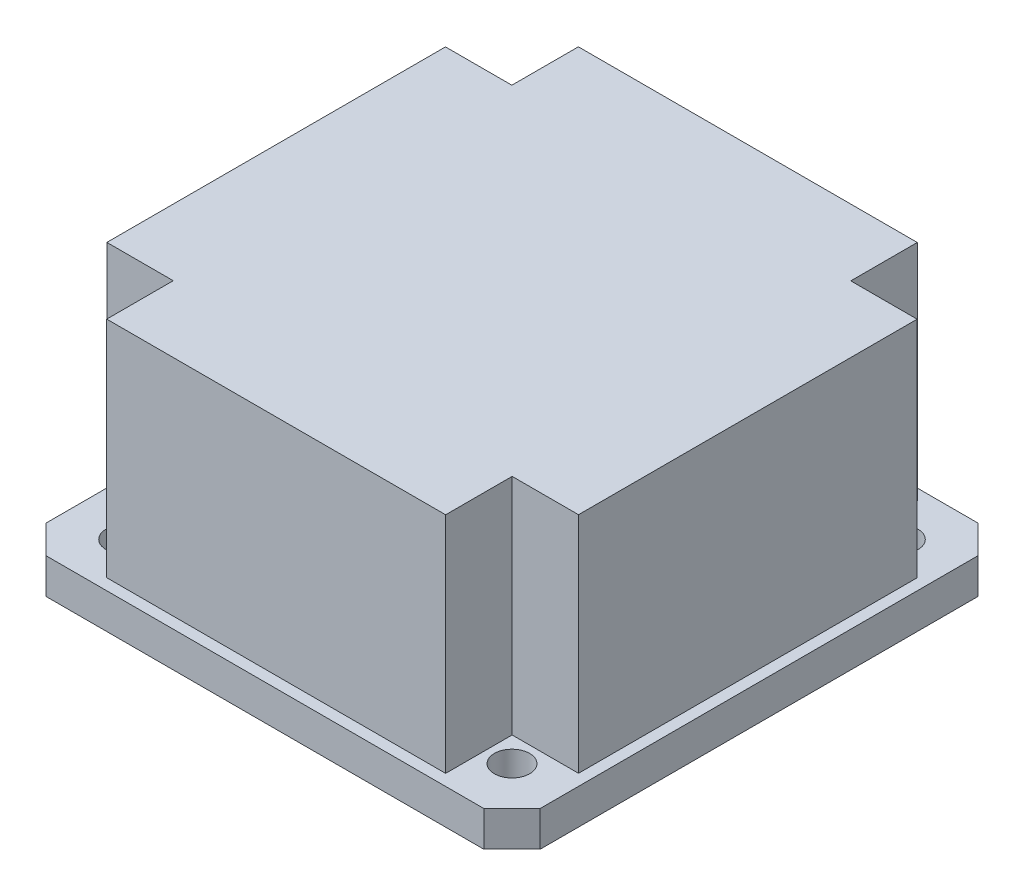
ISO-10303-21;
HEADER;
FILE_DESCRIPTION(('STEP AP214'),'2;1');
FILE_NAME('part.step','',(''),(''),'','','');
FILE_SCHEMA(('AUTOMOTIVE_DESIGN { 1 0 10303 214 1 1 1 1 }'));
ENDSEC;
DATA;
#1=APPLICATION_CONTEXT('core data for automotive mechanical design processes');
#2=APPLICATION_PROTOCOL_DEFINITION('international standard','automotive_design',2000,#1);
#3=PRODUCT_CONTEXT('',#1,'mechanical');
#4=PRODUCT('Part','Part','',(#3));
#5=PRODUCT_RELATED_PRODUCT_CATEGORY('part','',(#4));
#6=PRODUCT_DEFINITION_FORMATION('','',#4);
#7=PRODUCT_DEFINITION_CONTEXT('part definition',#1,'design');
#8=PRODUCT_DEFINITION('design','',#6,#7);
#9=PRODUCT_DEFINITION_SHAPE('','',#8);
#10=(LENGTH_UNIT() NAMED_UNIT(*) SI_UNIT(.MILLI.,.METRE.));
#11=(NAMED_UNIT(*) PLANE_ANGLE_UNIT() SI_UNIT($,.RADIAN.));
#12=(NAMED_UNIT(*) SI_UNIT($,.STERADIAN.) SOLID_ANGLE_UNIT());
#13=UNCERTAINTY_MEASURE_WITH_UNIT(LENGTH_MEASURE(1.E-05),#10,'distance_accuracy_value','');
#14=(GEOMETRIC_REPRESENTATION_CONTEXT(3) GLOBAL_UNCERTAINTY_ASSIGNED_CONTEXT((#13)) GLOBAL_UNIT_ASSIGNED_CONTEXT((#10,
#11,#12)) REPRESENTATION_CONTEXT('',''));
#15=CARTESIAN_POINT('',(0.,0.,0.));
#16=DIRECTION('',(0.,0.,1.));
#17=DIRECTION('',(1.,0.,0.));
#18=AXIS2_PLACEMENT_3D('',#15,#16,#17);
#19=CARTESIAN_POINT('',(0.,23.3172,0.));
#20=DIRECTION('',(0.,-1.,0.));
#21=DIRECTION('',(0.,0.,-1.));
#22=AXIS2_PLACEMENT_3D('',#19,#20,#21);
#23=PLANE('',#22);
#24=DIRECTION('',(0.,0.,1.));
#25=VECTOR('',#24,1.);
#26=CARTESIAN_POINT('',(15.24,23.3172,21.209));
#27=LINE('',#26,#25);
#28=CARTESIAN_POINT('',(15.24,23.3172,15.2273));
#29=VERTEX_POINT('',#28);
#30=CARTESIAN_POINT('',(15.24,23.3172,21.209));
#31=VERTEX_POINT('',#30);
#32=EDGE_CURVE('E211',#29,#31,#27,.T.);
#33=ORIENTED_EDGE('',*,*,#32,.F.);
#34=DIRECTION('',(-1.,0.,0.));
#35=VECTOR('',#34,1.);
#36=CARTESIAN_POINT('',(21.209,23.3172,15.2273));
#37=LINE('',#36,#35);
#38=CARTESIAN_POINT('',(21.209,23.3172,15.2273));
#39=VERTEX_POINT('',#38);
#40=EDGE_CURVE('E202',#39,#29,#37,.T.);
#41=ORIENTED_EDGE('',*,*,#40,.F.);
#42=DIRECTION('',(0.,0.,-1.));
#43=VECTOR('',#42,1.);
#44=CARTESIAN_POINT('',(21.209,23.3172,21.209));
#45=LINE('',#44,#43);
#46=CARTESIAN_POINT('',(21.209,23.3172,-15.2273));
#47=VERTEX_POINT('',#46);
#48=EDGE_CURVE('E298',#39,#47,#45,.T.);
#49=ORIENTED_EDGE('',*,*,#48,.T.);
#50=DIRECTION('',(-1.,0.,0.));
#51=VECTOR('',#50,1.);
#52=CARTESIAN_POINT('',(21.209,23.3172,-15.2273));
#53=LINE('',#52,#51);
#54=CARTESIAN_POINT('',(15.24,23.3172,-15.2273));
#55=VERTEX_POINT('',#54);
#56=EDGE_CURVE('E223',#47,#55,#53,.T.);
#57=ORIENTED_EDGE('',*,*,#56,.T.);
#58=DIRECTION('',(0.,0.,-1.));
#59=VECTOR('',#58,1.);
#60=CARTESIAN_POINT('',(15.24,23.3172,-21.209));
#61=LINE('',#60,#59);
#62=CARTESIAN_POINT('',(15.24,23.3172,-21.209));
#63=VERTEX_POINT('',#62);
#64=EDGE_CURVE('E229',#55,#63,#61,.T.);
#65=ORIENTED_EDGE('',*,*,#64,.T.);
#66=DIRECTION('',(-1.,0.,0.));
#67=VECTOR('',#66,1.);
#68=CARTESIAN_POINT('',(-21.209,23.3172,-21.209));
#69=LINE('',#68,#67);
#70=CARTESIAN_POINT('',(-15.24,23.3172,-21.209));
#71=VERTEX_POINT('',#70);
#72=EDGE_CURVE('E301',#63,#71,#69,.T.);
#73=ORIENTED_EDGE('',*,*,#72,.T.);
#74=DIRECTION('',(0.,0.,-1.));
#75=VECTOR('',#74,1.);
#76=CARTESIAN_POINT('',(-15.24,23.3172,-21.209));
#77=LINE('',#76,#75);
#78=CARTESIAN_POINT('',(-15.24,23.3172,-15.2273));
#79=VERTEX_POINT('',#78);
#80=EDGE_CURVE('E271',#79,#71,#77,.T.);
#81=ORIENTED_EDGE('',*,*,#80,.F.);
#82=DIRECTION('',(1.,0.,0.));
#83=VECTOR('',#82,1.);
#84=CARTESIAN_POINT('',(-21.209,23.3172,-15.2273));
#85=LINE('',#84,#83);
#86=CARTESIAN_POINT('',(-21.209,23.3172,-15.2273));
#87=VERTEX_POINT('',#86);
#88=EDGE_CURVE('E276',#87,#79,#85,.T.);
#89=ORIENTED_EDGE('',*,*,#88,.F.);
#90=DIRECTION('',(0.,0.,1.));
#91=VECTOR('',#90,1.);
#92=CARTESIAN_POINT('',(-21.209,23.3172,21.209));
#93=LINE('',#92,#91);
#94=CARTESIAN_POINT('',(-21.209,23.3172,15.2273));
#95=VERTEX_POINT('',#94);
#96=EDGE_CURVE('E304',#87,#95,#93,.T.);
#97=ORIENTED_EDGE('',*,*,#96,.T.);
#98=DIRECTION('',(1.,0.,0.));
#99=VECTOR('',#98,1.);
#100=CARTESIAN_POINT('',(-21.209,23.3172,15.2273));
#101=LINE('',#100,#99);
#102=CARTESIAN_POINT('',(-15.24,23.3172,15.2273));
#103=VERTEX_POINT('',#102);
#104=EDGE_CURVE('E248',#95,#103,#101,.T.);
#105=ORIENTED_EDGE('',*,*,#104,.T.);
#106=DIRECTION('',(0.,0.,1.));
#107=VECTOR('',#106,1.);
#108=CARTESIAN_POINT('',(-15.24,23.3172,21.209));
#109=LINE('',#108,#107);
#110=CARTESIAN_POINT('',(-15.24,23.3172,21.209));
#111=VERTEX_POINT('',#110);
#112=EDGE_CURVE('E253',#103,#111,#109,.T.);
#113=ORIENTED_EDGE('',*,*,#112,.T.);
#114=DIRECTION('',(1.,0.,0.));
#115=VECTOR('',#114,1.);
#116=CARTESIAN_POINT('',(-21.209,23.3172,21.209));
#117=LINE('',#116,#115);
#118=EDGE_CURVE('E308',#111,#31,#117,.T.);
#119=ORIENTED_EDGE('',*,*,#118,.T.);
#120=EDGE_LOOP('',(#33,#41,#49,#57,#65,#73,#81,#89,#97,#105,#113,#119));
#121=FACE_BOUND('',#120,.T.);
#122=ADVANCED_FACE('F44',(#121),#23,.F.);
#123=CARTESIAN_POINT('',(-21.209,23.3172,-21.209));
#124=DIRECTION('',(0.,0.,1.));
#125=DIRECTION('',(1.,0.,0.));
#126=AXIS2_PLACEMENT_3D('',#123,#124,#125);
#127=PLANE('',#126);
#128=DIRECTION('',(0.,1.,0.));
#129=VECTOR('',#128,1.);
#130=CARTESIAN_POINT('',(15.24,-5.27542578158047,-21.209));
#131=LINE('',#130,#129);
#132=CARTESIAN_POINT('',(15.24,3.175,-21.209));
#133=VERTEX_POINT('',#132);
#134=EDGE_CURVE('E233',#133,#63,#131,.T.);
#135=ORIENTED_EDGE('',*,*,#134,.F.);
#136=DIRECTION('',(-1.,0.,0.));
#137=VECTOR('',#136,1.);
#138=CARTESIAN_POINT('',(-21.209,3.175,-21.209));
#139=LINE('',#138,#137);
#140=CARTESIAN_POINT('',(-15.24,3.175,-21.209));
#141=VERTEX_POINT('',#140);
#142=EDGE_CURVE('E313',#133,#141,#139,.T.);
#143=ORIENTED_EDGE('',*,*,#142,.T.);
#144=DIRECTION('',(0.,1.,0.));
#145=VECTOR('',#144,1.);
#146=CARTESIAN_POINT('',(-15.24,-5.27542578158047,-21.209));
#147=LINE('',#146,#145);
#148=EDGE_CURVE('E288',#141,#71,#147,.T.);
#149=ORIENTED_EDGE('',*,*,#148,.T.);
#150=ORIENTED_EDGE('',*,*,#72,.F.);
#151=EDGE_LOOP('',(#135,#143,#149,#150));
#152=FACE_BOUND('',#151,.T.);
#153=ADVANCED_FACE('F477',(#152),#127,.F.);
#154=CARTESIAN_POINT('',(21.209,23.3172,21.209));
#155=DIRECTION('',(-1.,0.,0.));
#156=DIRECTION('',(0.,0.,1.));
#157=AXIS2_PLACEMENT_3D('',#154,#155,#156);
#158=PLANE('',#157);
#159=ORIENTED_EDGE('',*,*,#48,.F.);
#160=DIRECTION('',(0.,1.,0.));
#161=VECTOR('',#160,1.);
#162=CARTESIAN_POINT('',(21.209,-5.27542578158047,15.2273));
#163=LINE('',#162,#161);
#164=CARTESIAN_POINT('',(21.209,3.175,15.2273));
#165=VERTEX_POINT('',#164);
#166=EDGE_CURVE('E218',#165,#39,#163,.T.);
#167=ORIENTED_EDGE('',*,*,#166,.F.);
#168=DIRECTION('',(0.,0.,-1.));
#169=VECTOR('',#168,1.);
#170=CARTESIAN_POINT('',(21.209,3.175,21.209));
#171=LINE('',#170,#169);
#172=CARTESIAN_POINT('',(21.209,3.175,-15.2273));
#173=VERTEX_POINT('',#172);
#174=EDGE_CURVE('E11',#165,#173,#171,.T.);
#175=ORIENTED_EDGE('',*,*,#174,.T.);
#176=DIRECTION('',(0.,1.,0.));
#177=VECTOR('',#176,1.);
#178=CARTESIAN_POINT('',(21.209,-5.27542578158047,-15.2273));
#179=LINE('',#178,#177);
#180=EDGE_CURVE('E228',#173,#47,#179,.T.);
#181=ORIENTED_EDGE('',*,*,#180,.T.);
#182=EDGE_LOOP('',(#159,#167,#175,#181));
#183=FACE_BOUND('',#182,.T.);
#184=ADVANCED_FACE('F483',(#183),#158,.F.);
#185=CARTESIAN_POINT('',(-21.209,23.3172,21.209));
#186=DIRECTION('',(0.,0.,-1.));
#187=DIRECTION('',(-1.,0.,0.));
#188=AXIS2_PLACEMENT_3D('',#185,#186,#187);
#189=PLANE('',#188);
#190=DIRECTION('',(1.,0.,0.));
#191=VECTOR('',#190,1.);
#192=CARTESIAN_POINT('',(-21.209,3.175,21.209));
#193=LINE('',#192,#191);
#194=CARTESIAN_POINT('',(-15.24,3.175,21.209));
#195=VERTEX_POINT('',#194);
#196=CARTESIAN_POINT('',(15.24,3.175,21.209));
#197=VERTEX_POINT('',#196);
#198=EDGE_CURVE('E55',#195,#197,#193,.T.);
#199=ORIENTED_EDGE('',*,*,#198,.T.);
#200=DIRECTION('',(0.,1.,0.));
#201=VECTOR('',#200,1.);
#202=CARTESIAN_POINT('',(15.24,-5.27542578158047,21.209));
#203=LINE('',#202,#201);
#204=EDGE_CURVE('E191',#197,#31,#203,.T.);
#205=ORIENTED_EDGE('',*,*,#204,.T.);
#206=ORIENTED_EDGE('',*,*,#118,.F.);
#207=DIRECTION('',(0.,1.,0.));
#208=VECTOR('',#207,1.);
#209=CARTESIAN_POINT('',(-15.24,-5.27542578158047,21.209));
#210=LINE('',#209,#208);
#211=EDGE_CURVE('E257',#195,#111,#210,.T.);
#212=ORIENTED_EDGE('',*,*,#211,.F.);
#213=EDGE_LOOP('',(#199,#205,#206,#212));
#214=FACE_BOUND('',#213,.T.);
#215=ADVANCED_FACE('F490',(#214),#189,.F.);
#216=CARTESIAN_POINT('',(-21.209,23.3172,21.209));
#217=DIRECTION('',(1.,0.,0.));
#218=DIRECTION('',(0.,0.,-1.));
#219=AXIS2_PLACEMENT_3D('',#216,#217,#218);
#220=PLANE('',#219);
#221=DIRECTION('',(0.,1.,0.));
#222=VECTOR('',#221,1.);
#223=CARTESIAN_POINT('',(-21.209,-5.27542578158047,15.2273));
#224=LINE('',#223,#222);
#225=CARTESIAN_POINT('',(-21.209,3.175,15.2273));
#226=VERTEX_POINT('',#225);
#227=EDGE_CURVE('E69',#226,#95,#224,.T.);
#228=ORIENTED_EDGE('',*,*,#227,.T.);
#229=ORIENTED_EDGE('',*,*,#96,.F.);
#230=DIRECTION('',(0.,1.,0.));
#231=VECTOR('',#230,1.);
#232=CARTESIAN_POINT('',(-21.209,-5.27542578158047,-15.2273));
#233=LINE('',#232,#231);
#234=CARTESIAN_POINT('',(-21.209,3.175,-15.2273));
#235=VERTEX_POINT('',#234);
#236=EDGE_CURVE('E292',#235,#87,#233,.T.);
#237=ORIENTED_EDGE('',*,*,#236,.F.);
#238=DIRECTION('',(0.,0.,1.));
#239=VECTOR('',#238,1.);
#240=CARTESIAN_POINT('',(-21.209,3.175,21.209));
#241=LINE('',#240,#239);
#242=EDGE_CURVE('E316',#235,#226,#241,.T.);
#243=ORIENTED_EDGE('',*,*,#242,.T.);
#244=EDGE_LOOP('',(#228,#229,#237,#243));
#245=FACE_BOUND('',#244,.T.);
#246=ADVANCED_FACE('F493',(#245),#220,.F.);
#247=CARTESIAN_POINT('',(0.,3.175,0.));
#248=DIRECTION('',(0.,-1.,0.));
#249=DIRECTION('',(0.,0.,-1.));
#250=AXIS2_PLACEMENT_3D('',#247,#248,#249);
#251=PLANE('',#250);
#252=DIRECTION('',(-0.70710678118655,0.,0.707106781186546));
#253=VECTOR('',#252,1.);
#254=CARTESIAN_POINT('',(22.225,3.175,19.685));
#255=LINE('',#254,#253);
#256=CARTESIAN_POINT('',(19.685,3.175,22.225));
#257=VERTEX_POINT('',#256);
#258=CARTESIAN_POINT('',(22.225,3.175,19.685));
#259=VERTEX_POINT('',#258);
#260=EDGE_CURVE('E413',#257,#259,#255,.F.);
#261=ORIENTED_EDGE('',*,*,#260,.T.);
#262=DIRECTION('',(0.,0.,-1.));
#263=VECTOR('',#262,1.);
#264=CARTESIAN_POINT('',(22.225,3.175,22.225));
#265=LINE('',#264,#263);
#266=CARTESIAN_POINT('',(22.225,3.175,-19.685));
#267=VERTEX_POINT('',#266);
#268=EDGE_CURVE('E350',#259,#267,#265,.T.);
#269=ORIENTED_EDGE('',*,*,#268,.T.);
#270=DIRECTION('',(0.707106781186546,0.,0.70710678118655));
#271=VECTOR('',#270,1.);
#272=CARTESIAN_POINT('',(19.685,3.175,-22.225));
#273=LINE('',#272,#271);
#274=CARTESIAN_POINT('',(19.685,3.175,-22.225));
#275=VERTEX_POINT('',#274);
#276=EDGE_CURVE('E416',#267,#275,#273,.F.);
#277=ORIENTED_EDGE('',*,*,#276,.T.);
#278=DIRECTION('',(-1.,0.,0.));
#279=VECTOR('',#278,1.);
#280=CARTESIAN_POINT('',(-22.225,3.175,-22.225));
#281=LINE('',#280,#279);
#282=CARTESIAN_POINT('',(-19.685,3.175,-22.225));
#283=VERTEX_POINT('',#282);
#284=EDGE_CURVE('E354',#275,#283,#281,.T.);
#285=ORIENTED_EDGE('',*,*,#284,.T.);
#286=DIRECTION('',(0.707106781186549,0.,-0.707106781186547));
#287=VECTOR('',#286,1.);
#288=CARTESIAN_POINT('',(-22.225,3.175,-19.685));
#289=LINE('',#288,#287);
#290=CARTESIAN_POINT('',(-22.225,3.175,-19.685));
#291=VERTEX_POINT('',#290);
#292=EDGE_CURVE('E407',#283,#291,#289,.F.);
#293=ORIENTED_EDGE('',*,*,#292,.T.);
#294=DIRECTION('',(0.,0.,1.));
#295=VECTOR('',#294,1.);
#296=CARTESIAN_POINT('',(-22.225,3.175,22.225));
#297=LINE('',#296,#295);
#298=CARTESIAN_POINT('',(-22.225,3.175,19.685));
#299=VERTEX_POINT('',#298);
#300=EDGE_CURVE('E359',#291,#299,#297,.T.);
#301=ORIENTED_EDGE('',*,*,#300,.T.);
#302=DIRECTION('',(-0.707106781186547,0.,-0.707106781186549));
#303=VECTOR('',#302,1.);
#304=CARTESIAN_POINT('',(-19.685,3.175,22.225));
#305=LINE('',#304,#303);
#306=CARTESIAN_POINT('',(-19.685,3.175,22.225));
#307=VERTEX_POINT('',#306);
#308=EDGE_CURVE('E410',#299,#307,#305,.F.);
#309=ORIENTED_EDGE('',*,*,#308,.T.);
#310=DIRECTION('',(1.,0.,0.));
#311=VECTOR('',#310,1.);
#312=CARTESIAN_POINT('',(-22.225,3.175,22.225));
#313=LINE('',#312,#311);
#314=EDGE_CURVE('E363',#307,#257,#313,.T.);
#315=ORIENTED_EDGE('',*,*,#314,.T.);
#316=EDGE_LOOP('',(#261,#269,#277,#285,#293,#301,#309,#315));
#317=FACE_BOUND('',#316,.T.);
#318=ORIENTED_EDGE('',*,*,#142,.F.);
#319=DIRECTION('',(0.,0.,-1.));
#320=VECTOR('',#319,1.);
#321=CARTESIAN_POINT('',(15.24,3.175,-21.209));
#322=LINE('',#321,#320);
#323=CARTESIAN_POINT('',(15.24,3.175,-15.2273));
#324=VERTEX_POINT('',#323);
#325=EDGE_CURVE('E234',#324,#133,#322,.T.);
#326=ORIENTED_EDGE('',*,*,#325,.F.);
#327=DIRECTION('',(-1.,0.,0.));
#328=VECTOR('',#327,1.);
#329=CARTESIAN_POINT('',(21.209,3.175,-15.2273));
#330=LINE('',#329,#328);
#331=EDGE_CURVE('E238',#173,#324,#330,.T.);
#332=ORIENTED_EDGE('',*,*,#331,.F.);
#333=ORIENTED_EDGE('',*,*,#174,.F.);
#334=DIRECTION('',(-1.,0.,0.));
#335=VECTOR('',#334,1.);
#336=CARTESIAN_POINT('',(21.209,3.175,15.2273));
#337=LINE('',#336,#335);
#338=CARTESIAN_POINT('',(15.24,3.175,15.2273));
#339=VERTEX_POINT('',#338);
#340=EDGE_CURVE('E200',#165,#339,#337,.T.);
#341=ORIENTED_EDGE('',*,*,#340,.T.);
#342=DIRECTION('',(0.,0.,1.));
#343=VECTOR('',#342,1.);
#344=CARTESIAN_POINT('',(15.24,3.175,21.209));
#345=LINE('',#344,#343);
#346=EDGE_CURVE('E185',#339,#197,#345,.T.);
#347=ORIENTED_EDGE('',*,*,#346,.T.);
#348=ORIENTED_EDGE('',*,*,#198,.F.);
#349=DIRECTION('',(0.,0.,1.));
#350=VECTOR('',#349,1.);
#351=CARTESIAN_POINT('',(-15.24,3.175,21.209));
#352=LINE('',#351,#350);
#353=CARTESIAN_POINT('',(-15.24,3.175,15.2273));
#354=VERTEX_POINT('',#353);
#355=EDGE_CURVE('E258',#354,#195,#352,.T.);
#356=ORIENTED_EDGE('',*,*,#355,.F.);
#357=DIRECTION('',(1.,0.,0.));
#358=VECTOR('',#357,1.);
#359=CARTESIAN_POINT('',(-21.209,3.175,15.2273));
#360=LINE('',#359,#358);
#361=EDGE_CURVE('E262',#226,#354,#360,.T.);
#362=ORIENTED_EDGE('',*,*,#361,.F.);
#363=ORIENTED_EDGE('',*,*,#242,.F.);
#364=DIRECTION('',(1.,0.,0.));
#365=VECTOR('',#364,1.);
#366=CARTESIAN_POINT('',(-21.209,3.175,-15.2273));
#367=LINE('',#366,#365);
#368=CARTESIAN_POINT('',(-15.24,3.175,-15.2273));
#369=VERTEX_POINT('',#368);
#370=EDGE_CURVE('E275',#235,#369,#367,.T.);
#371=ORIENTED_EDGE('',*,*,#370,.T.);
#372=DIRECTION('',(0.,0.,-1.));
#373=VECTOR('',#372,1.);
#374=CARTESIAN_POINT('',(-15.24,3.175,-21.209));
#375=LINE('',#374,#373);
#376=EDGE_CURVE('E284',#369,#141,#375,.T.);
#377=ORIENTED_EDGE('',*,*,#376,.T.);
#378=EDGE_LOOP('',(#318,#326,#332,#333,#341,#347,#348,#356,#362,#363,#371,#377));
#379=FACE_BOUND('',#378,.T.);
#380=CARTESIAN_POINT('',(-17.4625,3.175,-17.4625));
#381=DIRECTION('',(0.,1.,0.));
#382=DIRECTION('',(0.,0.,1.));
#383=AXIS2_PLACEMENT_3D('',#380,#381,#382);
#384=CIRCLE('',#383,1.5875);
#385=CARTESIAN_POINT('',(-17.4625,3.175,-15.875));
#386=VERTEX_POINT('',#385);
#387=EDGE_CURVE('E297',#386,#386,#384,.T.);
#388=ORIENTED_EDGE('',*,*,#387,.F.);
#389=EDGE_LOOP('',(#388));
#390=FACE_BOUND('',#389,.T.);
#391=CARTESIAN_POINT('',(-17.4625,3.175,17.4625));
#392=DIRECTION('',(0.,-1.,0.));
#393=DIRECTION('',(0.,0.,-1.));
#394=AXIS2_PLACEMENT_3D('',#391,#392,#393);
#395=CIRCLE('',#394,1.5875);
#396=CARTESIAN_POINT('',(-17.4625,3.175,15.875));
#397=VERTEX_POINT('',#396);
#398=EDGE_CURVE('E261',#397,#397,#395,.T.);
#399=ORIENTED_EDGE('',*,*,#398,.T.);
#400=EDGE_LOOP('',(#399));
#401=FACE_BOUND('',#400,.T.);
#402=CARTESIAN_POINT('',(17.4625,3.175,-17.4625));
#403=DIRECTION('',(0.,-1.,0.));
#404=DIRECTION('',(0.,0.,1.));
#405=AXIS2_PLACEMENT_3D('',#402,#403,#404);
#406=CIRCLE('',#405,1.5875);
#407=CARTESIAN_POINT('',(17.4625,3.175,-15.875));
#408=VERTEX_POINT('',#407);
#409=EDGE_CURVE('E237',#408,#408,#406,.T.);
#410=ORIENTED_EDGE('',*,*,#409,.T.);
#411=EDGE_LOOP('',(#410));
#412=FACE_BOUND('',#411,.T.);
#413=CARTESIAN_POINT('',(17.4625,3.175,17.4625));
#414=DIRECTION('',(0.,1.,0.));
#415=DIRECTION('',(0.,0.,-1.));
#416=AXIS2_PLACEMENT_3D('',#413,#414,#415);
#417=CIRCLE('',#416,1.5875);
#418=CARTESIAN_POINT('',(17.4625,3.175,15.875));
#419=VERTEX_POINT('',#418);
#420=EDGE_CURVE('E222',#419,#419,#417,.T.);
#421=ORIENTED_EDGE('',*,*,#420,.F.);
#422=EDGE_LOOP('',(#421));
#423=FACE_BOUND('',#422,.T.);
#424=ADVANCED_FACE('F207',(#317,#379,#390,#401,#412,#423),#251,.F.);
#425=CARTESIAN_POINT('',(22.225,3.175,22.225));
#426=DIRECTION('',(-1.,0.,0.));
#427=DIRECTION('',(0.,0.,1.));
#428=AXIS2_PLACEMENT_3D('',#425,#426,#427);
#429=PLANE('',#428);
#430=DIRECTION('',(0.,0.,-1.));
#431=VECTOR('',#430,1.);
#432=CARTESIAN_POINT('',(22.225,0.,22.225));
#433=LINE('',#432,#431);
#434=CARTESIAN_POINT('',(22.225,0.,19.685));
#435=VERTEX_POINT('',#434);
#436=CARTESIAN_POINT('',(22.225,0.,-19.685));
#437=VERTEX_POINT('',#436);
#438=EDGE_CURVE('E346',#435,#437,#433,.T.);
#439=ORIENTED_EDGE('',*,*,#438,.T.);
#440=DIRECTION('',(0.,1.,0.));
#441=VECTOR('',#440,1.);
#442=CARTESIAN_POINT('',(22.225,3.175,-19.685));
#443=LINE('',#442,#441);
#444=EDGE_CURVE('E404',#437,#267,#443,.T.);
#445=ORIENTED_EDGE('',*,*,#444,.T.);
#446=ORIENTED_EDGE('',*,*,#268,.F.);
#447=DIRECTION('',(0.,-1.,0.));
#448=VECTOR('',#447,1.);
#449=CARTESIAN_POINT('',(22.225,3.175,19.685));
#450=LINE('',#449,#448);
#451=EDGE_CURVE('E400',#259,#435,#450,.T.);
#452=ORIENTED_EDGE('',*,*,#451,.T.);
#453=EDGE_LOOP('',(#439,#445,#446,#452));
#454=FACE_BOUND('',#453,.T.);
#455=ADVANCED_FACE('F456',(#454),#429,.F.);
#456=CARTESIAN_POINT('',(-22.225,3.175,-22.225));
#457=DIRECTION('',(0.,0.,1.));
#458=DIRECTION('',(1.,0.,0.));
#459=AXIS2_PLACEMENT_3D('',#456,#457,#458);
#460=PLANE('',#459);
#461=ORIENTED_EDGE('',*,*,#284,.F.);
#462=DIRECTION('',(0.,-1.,0.));
#463=VECTOR('',#462,1.);
#464=CARTESIAN_POINT('',(19.685,3.175,-22.225));
#465=LINE('',#464,#463);
#466=CARTESIAN_POINT('',(19.685,0.,-22.225));
#467=VERTEX_POINT('',#466);
#468=EDGE_CURVE('E384',#275,#467,#465,.T.);
#469=ORIENTED_EDGE('',*,*,#468,.T.);
#470=DIRECTION('',(-1.,0.,0.));
#471=VECTOR('',#470,1.);
#472=CARTESIAN_POINT('',(-22.225,0.,-22.225));
#473=LINE('',#472,#471);
#474=CARTESIAN_POINT('',(-19.685,0.,-22.225));
#475=VERTEX_POINT('',#474);
#476=EDGE_CURVE('E371',#467,#475,#473,.T.);
#477=ORIENTED_EDGE('',*,*,#476,.T.);
#478=DIRECTION('',(0.,1.,0.));
#479=VECTOR('',#478,1.);
#480=CARTESIAN_POINT('',(-19.685,3.175,-22.225));
#481=LINE('',#480,#479);
#482=EDGE_CURVE('E367',#475,#283,#481,.T.);
#483=ORIENTED_EDGE('',*,*,#482,.T.);
#484=EDGE_LOOP('',(#461,#469,#477,#483));
#485=FACE_BOUND('',#484,.T.);
#486=ADVANCED_FACE('F464',(#485),#460,.F.);
#487=CARTESIAN_POINT('',(-22.225,3.175,22.225));
#488=DIRECTION('',(1.,0.,0.));
#489=DIRECTION('',(0.,0.,-1.));
#490=AXIS2_PLACEMENT_3D('',#487,#488,#489);
#491=PLANE('',#490);
#492=DIRECTION('',(0.,0.,1.));
#493=VECTOR('',#492,1.);
#494=CARTESIAN_POINT('',(-22.225,0.,22.225));
#495=LINE('',#494,#493);
#496=CARTESIAN_POINT('',(-22.225,0.,-19.685));
#497=VERTEX_POINT('',#496);
#498=CARTESIAN_POINT('',(-22.225,0.,19.685));
#499=VERTEX_POINT('',#498);
#500=EDGE_CURVE('E375',#497,#499,#495,.T.);
#501=ORIENTED_EDGE('',*,*,#500,.T.);
#502=DIRECTION('',(0.,1.,0.));
#503=VECTOR('',#502,1.);
#504=CARTESIAN_POINT('',(-22.225,3.175,19.685));
#505=LINE('',#504,#503);
#506=EDGE_CURVE('E49',#499,#299,#505,.T.);
#507=ORIENTED_EDGE('',*,*,#506,.T.);
#508=ORIENTED_EDGE('',*,*,#300,.F.);
#509=DIRECTION('',(0.,-1.,0.));
#510=VECTOR('',#509,1.);
#511=CARTESIAN_POINT('',(-22.225,3.175,-19.685));
#512=LINE('',#511,#510);
#513=EDGE_CURVE('E425',#291,#497,#512,.T.);
#514=ORIENTED_EDGE('',*,*,#513,.T.);
#515=EDGE_LOOP('',(#501,#507,#508,#514));
#516=FACE_BOUND('',#515,.T.);
#517=ADVANCED_FACE('F434',(#516),#491,.F.);
#518=CARTESIAN_POINT('',(-22.225,3.175,22.225));
#519=DIRECTION('',(0.,0.,-1.));
#520=DIRECTION('',(-1.,0.,0.));
#521=AXIS2_PLACEMENT_3D('',#518,#519,#520);
#522=PLANE('',#521);
#523=DIRECTION('',(1.,0.,0.));
#524=VECTOR('',#523,1.);
#525=CARTESIAN_POINT('',(-22.225,0.,22.225));
#526=LINE('',#525,#524);
#527=CARTESIAN_POINT('',(-19.685,0.,22.225));
#528=VERTEX_POINT('',#527);
#529=CARTESIAN_POINT('',(19.685,0.,22.225));
#530=VERTEX_POINT('',#529);
#531=EDGE_CURVE('E355',#528,#530,#526,.T.);
#532=ORIENTED_EDGE('',*,*,#531,.T.);
#533=DIRECTION('',(0.,1.,0.));
#534=VECTOR('',#533,1.);
#535=CARTESIAN_POINT('',(19.685,3.175,22.225));
#536=LINE('',#535,#534);
#537=EDGE_CURVE('E423',#530,#257,#536,.T.);
#538=ORIENTED_EDGE('',*,*,#537,.T.);
#539=ORIENTED_EDGE('',*,*,#314,.F.);
#540=DIRECTION('',(0.,-1.,0.));
#541=VECTOR('',#540,1.);
#542=CARTESIAN_POINT('',(-19.685,3.175,22.225));
#543=LINE('',#542,#541);
#544=EDGE_CURVE('E419',#307,#528,#543,.T.);
#545=ORIENTED_EDGE('',*,*,#544,.T.);
#546=EDGE_LOOP('',(#532,#538,#539,#545));
#547=FACE_BOUND('',#546,.T.);
#548=ADVANCED_FACE('F444',(#547),#522,.F.);
#549=CARTESIAN_POINT('',(0.,0.,0.));
#550=DIRECTION('',(0.,-1.,0.));
#551=DIRECTION('',(0.,0.,-1.));
#552=AXIS2_PLACEMENT_3D('',#549,#550,#551);
#553=PLANE('',#552);
#554=CARTESIAN_POINT('',(-17.4625,0.,17.4625));
#555=DIRECTION('',(0.,-1.,0.));
#556=DIRECTION('',(0.,0.,-1.));
#557=AXIS2_PLACEMENT_3D('',#554,#555,#556);
#558=CIRCLE('',#557,1.5875);
#559=CARTESIAN_POINT('',(-17.4625,0.,15.875));
#560=VERTEX_POINT('',#559);
#561=EDGE_CURVE('E311',#560,#560,#558,.T.);
#562=ORIENTED_EDGE('',*,*,#561,.F.);
#563=EDGE_LOOP('',(#562));
#564=FACE_BOUND('',#563,.T.);
#565=CARTESIAN_POINT('',(17.4625,0.,17.4625));
#566=DIRECTION('',(0.,1.,0.));
#567=DIRECTION('',(0.,0.,-1.));
#568=AXIS2_PLACEMENT_3D('',#565,#566,#567);
#569=CIRCLE('',#568,1.5875);
#570=CARTESIAN_POINT('',(17.4625,0.,15.875));
#571=VERTEX_POINT('',#570);
#572=EDGE_CURVE('E325',#571,#571,#569,.T.);
#573=ORIENTED_EDGE('',*,*,#572,.T.);
#574=EDGE_LOOP('',(#573));
#575=FACE_BOUND('',#574,.T.);
#576=CARTESIAN_POINT('',(17.4625,0.,-17.4625));
#577=DIRECTION('',(0.,-1.,0.));
#578=DIRECTION('',(0.,0.,1.));
#579=AXIS2_PLACEMENT_3D('',#576,#577,#578);
#580=CIRCLE('',#579,1.5875);
#581=CARTESIAN_POINT('',(17.4625,0.,-15.875));
#582=VERTEX_POINT('',#581);
#583=EDGE_CURVE('E332',#582,#582,#580,.T.);
#584=ORIENTED_EDGE('',*,*,#583,.F.);
#585=EDGE_LOOP('',(#584));
#586=FACE_BOUND('',#585,.T.);
#587=CARTESIAN_POINT('',(-17.4625,0.,-17.4625));
#588=DIRECTION('',(0.,1.,0.));
#589=DIRECTION('',(0.,0.,1.));
#590=AXIS2_PLACEMENT_3D('',#587,#588,#589);
#591=CIRCLE('',#590,1.5875);
#592=CARTESIAN_POINT('',(-17.4625,0.,-15.875));
#593=VERTEX_POINT('',#592);
#594=EDGE_CURVE('E339',#593,#593,#591,.T.);
#595=ORIENTED_EDGE('',*,*,#594,.T.);
#596=EDGE_LOOP('',(#595));
#597=FACE_BOUND('',#596,.T.);
#598=ORIENTED_EDGE('',*,*,#476,.F.);
#599=DIRECTION('',(-0.707106781186546,0.,-0.70710678118655));
#600=VECTOR('',#599,1.);
#601=CARTESIAN_POINT('',(20.9550000000001,0.,-20.9549999999999));
#602=LINE('',#601,#600);
#603=EDGE_CURVE('E397',#467,#437,#602,.F.);
#604=ORIENTED_EDGE('',*,*,#603,.T.);
#605=ORIENTED_EDGE('',*,*,#438,.F.);
#606=DIRECTION('',(0.70710678118655,0.,-0.707106781186546));
#607=VECTOR('',#606,1.);
#608=CARTESIAN_POINT('',(20.9549999999999,0.,20.955));
#609=LINE('',#608,#607);
#610=EDGE_CURVE('E394',#435,#530,#609,.F.);
#611=ORIENTED_EDGE('',*,*,#610,.T.);
#612=ORIENTED_EDGE('',*,*,#531,.F.);
#613=DIRECTION('',(0.707106781186547,0.,0.707106781186549));
#614=VECTOR('',#613,1.);
#615=CARTESIAN_POINT('',(-20.955,0.,20.955));
#616=LINE('',#615,#614);
#617=EDGE_CURVE('E391',#528,#499,#616,.F.);
#618=ORIENTED_EDGE('',*,*,#617,.T.);
#619=ORIENTED_EDGE('',*,*,#500,.F.);
#620=DIRECTION('',(-0.707106781186549,0.,0.707106781186547));
#621=VECTOR('',#620,1.);
#622=CARTESIAN_POINT('',(-20.955,0.,-20.955));
#623=LINE('',#622,#621);
#624=EDGE_CURVE('E388',#497,#475,#623,.F.);
#625=ORIENTED_EDGE('',*,*,#624,.T.);
#626=EDGE_LOOP('',(#598,#604,#605,#611,#612,#618,#619,#625));
#627=FACE_BOUND('',#626,.T.);
#628=ADVANCED_FACE('F448',(#564,#575,#586,#597,#627),#553,.T.);
#629=CARTESIAN_POINT('',(19.685,3.175,-22.225));
#630=DIRECTION('',(-0.70710678118655,0.,0.707106781186546));
#631=DIRECTION('',(0.,-1.,0.));
#632=AXIS2_PLACEMENT_3D('',#629,#630,#631);
#633=PLANE('',#632);
#634=ORIENTED_EDGE('',*,*,#276,.F.);
#635=ORIENTED_EDGE('',*,*,#444,.F.);
#636=ORIENTED_EDGE('',*,*,#603,.F.);
#637=ORIENTED_EDGE('',*,*,#468,.F.);
#638=EDGE_LOOP('',(#634,#635,#636,#637));
#639=FACE_BOUND('',#638,.T.);
#640=ADVANCED_FACE('F462',(#639),#633,.F.);
#641=CARTESIAN_POINT('',(22.225,3.175,19.685));
#642=DIRECTION('',(-0.707106781186546,0.,-0.70710678118655));
#643=DIRECTION('',(0.,-1.,0.));
#644=AXIS2_PLACEMENT_3D('',#641,#642,#643);
#645=PLANE('',#644);
#646=ORIENTED_EDGE('',*,*,#260,.F.);
#647=ORIENTED_EDGE('',*,*,#537,.F.);
#648=ORIENTED_EDGE('',*,*,#610,.F.);
#649=ORIENTED_EDGE('',*,*,#451,.F.);
#650=EDGE_LOOP('',(#646,#647,#648,#649));
#651=FACE_BOUND('',#650,.T.);
#652=ADVANCED_FACE('F453',(#651),#645,.F.);
#653=CARTESIAN_POINT('',(-19.685,3.175,22.225));
#654=DIRECTION('',(0.707106781186549,0.,-0.707106781186547));
#655=DIRECTION('',(0.,-1.,0.));
#656=AXIS2_PLACEMENT_3D('',#653,#654,#655);
#657=PLANE('',#656);
#658=ORIENTED_EDGE('',*,*,#308,.F.);
#659=ORIENTED_EDGE('',*,*,#506,.F.);
#660=ORIENTED_EDGE('',*,*,#617,.F.);
#661=ORIENTED_EDGE('',*,*,#544,.F.);
#662=EDGE_LOOP('',(#658,#659,#660,#661));
#663=FACE_BOUND('',#662,.T.);
#664=ADVANCED_FACE('F441',(#663),#657,.F.);
#665=CARTESIAN_POINT('',(-22.225,3.175,-19.685));
#666=DIRECTION('',(0.707106781186547,0.,0.707106781186549));
#667=DIRECTION('',(0.,-1.,0.));
#668=AXIS2_PLACEMENT_3D('',#665,#666,#667);
#669=PLANE('',#668);
#670=ORIENTED_EDGE('',*,*,#292,.F.);
#671=ORIENTED_EDGE('',*,*,#482,.F.);
#672=ORIENTED_EDGE('',*,*,#624,.F.);
#673=ORIENTED_EDGE('',*,*,#513,.F.);
#674=EDGE_LOOP('',(#670,#671,#672,#673));
#675=FACE_BOUND('',#674,.T.);
#676=ADVANCED_FACE('F47',(#675),#669,.F.);
#677=CARTESIAN_POINT('',(-17.4625,0.,-17.4625));
#678=DIRECTION('',(0.,1.,0.));
#679=DIRECTION('',(0.,0.,1.));
#680=AXIS2_PLACEMENT_3D('',#677,#678,#679);
#681=CYLINDRICAL_SURFACE('',#680,1.5875);
#682=ORIENTED_EDGE('',*,*,#594,.F.);
#683=EDGE_LOOP('',(#682));
#684=FACE_BOUND('',#683,.T.);
#685=ORIENTED_EDGE('',*,*,#387,.T.);
#686=EDGE_LOOP('',(#685));
#687=FACE_BOUND('',#686,.T.);
#688=ADVANCED_FACE('F468',(#684,#687),#681,.F.);
#689=CARTESIAN_POINT('',(17.4625,0.,-17.4625));
#690=DIRECTION('',(0.,1.,0.));
#691=DIRECTION('',(0.,0.,1.));
#692=AXIS2_PLACEMENT_3D('',#689,#690,#691);
#693=CYLINDRICAL_SURFACE('',#692,1.5875);
#694=ORIENTED_EDGE('',*,*,#583,.T.);
#695=EDGE_LOOP('',(#694));
#696=FACE_BOUND('',#695,.T.);
#697=ORIENTED_EDGE('',*,*,#409,.F.);
#698=EDGE_LOOP('',(#697));
#699=FACE_BOUND('',#698,.T.);
#700=ADVANCED_FACE('F473',(#696,#699),#693,.F.);
#701=CARTESIAN_POINT('',(17.4625,0.,17.4625));
#702=DIRECTION('',(0.,1.,0.));
#703=DIRECTION('',(0.,0.,1.));
#704=AXIS2_PLACEMENT_3D('',#701,#702,#703);
#705=CYLINDRICAL_SURFACE('',#704,1.5875);
#706=ORIENTED_EDGE('',*,*,#572,.F.);
#707=EDGE_LOOP('',(#706));
#708=FACE_BOUND('',#707,.T.);
#709=ORIENTED_EDGE('',*,*,#420,.T.);
#710=EDGE_LOOP('',(#709));
#711=FACE_BOUND('',#710,.T.);
#712=ADVANCED_FACE('F503',(#708,#711),#705,.F.);
#713=CARTESIAN_POINT('',(-17.4625,0.,17.4625));
#714=DIRECTION('',(0.,1.,0.));
#715=DIRECTION('',(0.,0.,1.));
#716=AXIS2_PLACEMENT_3D('',#713,#714,#715);
#717=CYLINDRICAL_SURFACE('',#716,1.5875);
#718=ORIENTED_EDGE('',*,*,#561,.T.);
#719=EDGE_LOOP('',(#718));
#720=FACE_BOUND('',#719,.T.);
#721=ORIENTED_EDGE('',*,*,#398,.F.);
#722=EDGE_LOOP('',(#721));
#723=FACE_BOUND('',#722,.T.);
#724=ADVANCED_FACE('F500',(#720,#723),#717,.F.);
#725=CARTESIAN_POINT('',(-21.209,-5.27542578158047,-15.2273));
#726=DIRECTION('',(0.,0.,1.));
#727=DIRECTION('',(1.,0.,0.));
#728=AXIS2_PLACEMENT_3D('',#725,#726,#727);
#729=PLANE('',#728);
#730=ORIENTED_EDGE('',*,*,#236,.T.);
#731=ORIENTED_EDGE('',*,*,#88,.T.);
#732=DIRECTION('',(0.,1.,0.));
#733=VECTOR('',#732,1.);
#734=CARTESIAN_POINT('',(-15.24,-5.27542578158047,-15.2273));
#735=LINE('',#734,#733);
#736=EDGE_CURVE('E283',#369,#79,#735,.T.);
#737=ORIENTED_EDGE('',*,*,#736,.F.);
#738=ORIENTED_EDGE('',*,*,#370,.F.);
#739=EDGE_LOOP('',(#730,#731,#737,#738));
#740=FACE_BOUND('',#739,.T.);
#741=ADVANCED_FACE('F488',(#740),#729,.F.);
#742=CARTESIAN_POINT('',(-15.24,-5.27542578158047,-21.209));
#743=DIRECTION('',(1.,0.,0.));
#744=DIRECTION('',(0.,0.,-1.));
#745=AXIS2_PLACEMENT_3D('',#742,#743,#744);
#746=PLANE('',#745);
#747=ORIENTED_EDGE('',*,*,#736,.T.);
#748=ORIENTED_EDGE('',*,*,#80,.T.);
#749=ORIENTED_EDGE('',*,*,#148,.F.);
#750=ORIENTED_EDGE('',*,*,#376,.F.);
#751=EDGE_LOOP('',(#747,#748,#749,#750));
#752=FACE_BOUND('',#751,.T.);
#753=ADVANCED_FACE('F559',(#752),#746,.F.);
#754=CARTESIAN_POINT('',(-21.209,-5.27542578158047,15.2273));
#755=DIRECTION('',(0.,0.,1.));
#756=DIRECTION('',(1.,0.,0.));
#757=AXIS2_PLACEMENT_3D('',#754,#755,#756);
#758=PLANE('',#757);
#759=ORIENTED_EDGE('',*,*,#361,.T.);
#760=DIRECTION('',(0.,1.,0.));
#761=VECTOR('',#760,1.);
#762=CARTESIAN_POINT('',(-15.24,-5.27542578158047,15.2273));
#763=LINE('',#762,#761);
#764=EDGE_CURVE('E252',#354,#103,#763,.T.);
#765=ORIENTED_EDGE('',*,*,#764,.T.);
#766=ORIENTED_EDGE('',*,*,#104,.F.);
#767=ORIENTED_EDGE('',*,*,#227,.F.);
#768=EDGE_LOOP('',(#759,#765,#766,#767));
#769=FACE_BOUND('',#768,.T.);
#770=ADVANCED_FACE('F553',(#769),#758,.T.);
#771=CARTESIAN_POINT('',(-15.24,-5.27542578158047,21.209));
#772=DIRECTION('',(-1.,0.,0.));
#773=DIRECTION('',(0.,0.,1.));
#774=AXIS2_PLACEMENT_3D('',#771,#772,#773);
#775=PLANE('',#774);
#776=ORIENTED_EDGE('',*,*,#355,.T.);
#777=ORIENTED_EDGE('',*,*,#211,.T.);
#778=ORIENTED_EDGE('',*,*,#112,.F.);
#779=ORIENTED_EDGE('',*,*,#764,.F.);
#780=EDGE_LOOP('',(#776,#777,#778,#779));
#781=FACE_BOUND('',#780,.T.);
#782=ADVANCED_FACE('F558',(#781),#775,.T.);
#783=CARTESIAN_POINT('',(21.209,-5.27542578158047,-15.2273));
#784=DIRECTION('',(0.,0.,-1.));
#785=DIRECTION('',(-1.,0.,0.));
#786=AXIS2_PLACEMENT_3D('',#783,#784,#785);
#787=PLANE('',#786);
#788=ORIENTED_EDGE('',*,*,#331,.T.);
#789=DIRECTION('',(0.,1.,0.));
#790=VECTOR('',#789,1.);
#791=CARTESIAN_POINT('',(15.24,-5.27542578158047,-15.2273));
#792=LINE('',#791,#790);
#793=EDGE_CURVE('E227',#324,#55,#792,.T.);
#794=ORIENTED_EDGE('',*,*,#793,.T.);
#795=ORIENTED_EDGE('',*,*,#56,.F.);
#796=ORIENTED_EDGE('',*,*,#180,.F.);
#797=EDGE_LOOP('',(#788,#794,#795,#796));
#798=FACE_BOUND('',#797,.T.);
#799=ADVANCED_FACE('F571',(#798),#787,.T.);
#800=CARTESIAN_POINT('',(15.24,-5.27542578158047,-21.209));
#801=DIRECTION('',(1.,0.,0.));
#802=DIRECTION('',(0.,0.,-1.));
#803=AXIS2_PLACEMENT_3D('',#800,#801,#802);
#804=PLANE('',#803);
#805=ORIENTED_EDGE('',*,*,#325,.T.);
#806=ORIENTED_EDGE('',*,*,#134,.T.);
#807=ORIENTED_EDGE('',*,*,#64,.F.);
#808=ORIENTED_EDGE('',*,*,#793,.F.);
#809=EDGE_LOOP('',(#805,#806,#807,#808));
#810=FACE_BOUND('',#809,.T.);
#811=ADVANCED_FACE('F582',(#810),#804,.T.);
#812=CARTESIAN_POINT('',(21.209,-5.27542578158047,15.2273));
#813=DIRECTION('',(0.,0.,-1.));
#814=DIRECTION('',(-1.,0.,0.));
#815=AXIS2_PLACEMENT_3D('',#812,#813,#814);
#816=PLANE('',#815);
#817=ORIENTED_EDGE('',*,*,#166,.T.);
#818=ORIENTED_EDGE('',*,*,#40,.T.);
#819=DIRECTION('',(0.,1.,0.));
#820=VECTOR('',#819,1.);
#821=CARTESIAN_POINT('',(15.24,-5.27542578158047,15.2273));
#822=LINE('',#821,#820);
#823=EDGE_CURVE('E188',#339,#29,#822,.T.);
#824=ORIENTED_EDGE('',*,*,#823,.F.);
#825=ORIENTED_EDGE('',*,*,#340,.F.);
#826=EDGE_LOOP('',(#817,#818,#824,#825));
#827=FACE_BOUND('',#826,.T.);
#828=ADVANCED_FACE('F199',(#827),#816,.F.);
#829=CARTESIAN_POINT('',(15.24,-5.27542578158047,21.209));
#830=DIRECTION('',(-1.,0.,0.));
#831=DIRECTION('',(0.,0.,1.));
#832=AXIS2_PLACEMENT_3D('',#829,#830,#831);
#833=PLANE('',#832);
#834=ORIENTED_EDGE('',*,*,#823,.T.);
#835=ORIENTED_EDGE('',*,*,#32,.T.);
#836=ORIENTED_EDGE('',*,*,#204,.F.);
#837=ORIENTED_EDGE('',*,*,#346,.F.);
#838=EDGE_LOOP('',(#834,#835,#836,#837));
#839=FACE_BOUND('',#838,.T.);
#840=ADVANCED_FACE('F187',(#839),#833,.F.);
#841=CLOSED_SHELL('',(#122,#153,#184,#215,#246,#424,#455,#486,#517,#548,#628,#640,#652,#664,
#676,#688,#700,#712,#724,#741,#753,#770,#782,#799,#811,#828,#840));
#842=MANIFOLD_SOLID_BREP('B2',#841);
#843=ADVANCED_BREP_SHAPE_REPRESENTATION('',(#18,#842),#14);
#844=SHAPE_DEFINITION_REPRESENTATION(#9,#843);
ENDSEC;
END-ISO-10303-21;
